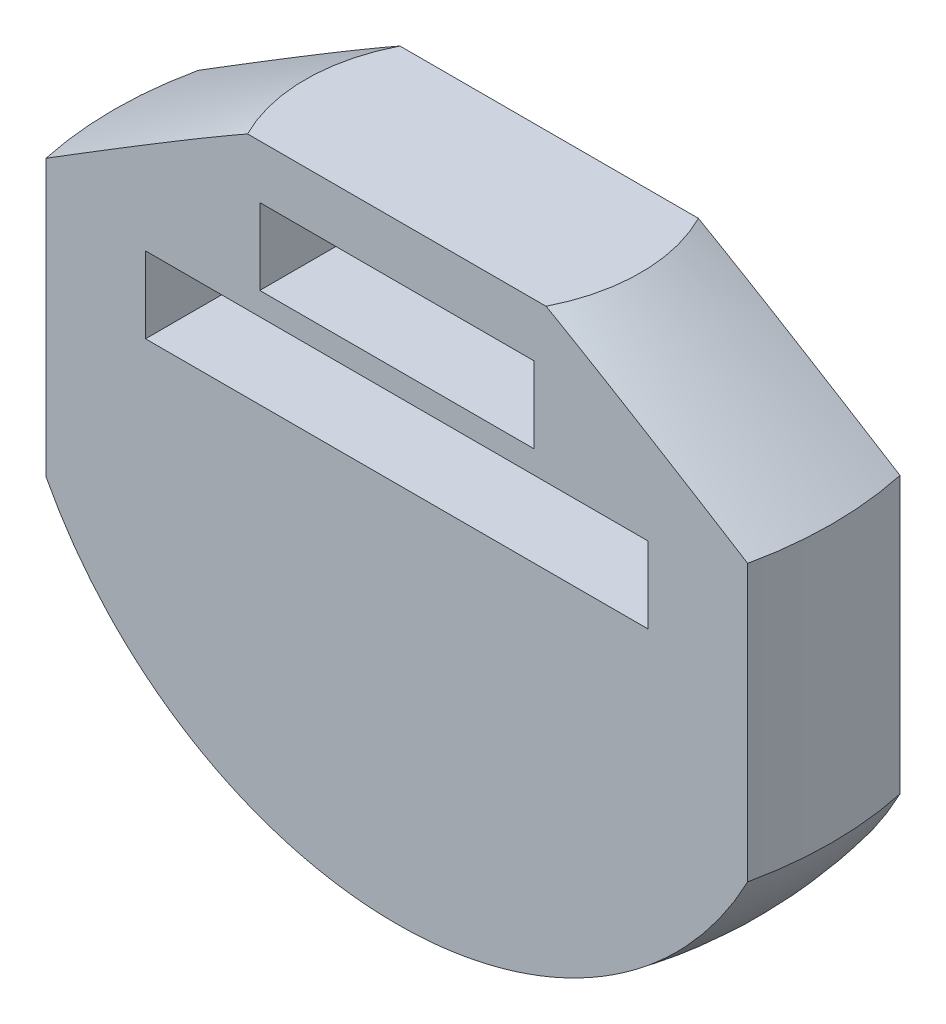
ISO-10303-21;
HEADER;
FILE_DESCRIPTION(('STEP AP214'),'2;1');
FILE_NAME('part.step','',(''),(''),'','','');
FILE_SCHEMA(('AUTOMOTIVE_DESIGN { 1 0 10303 214 1 1 1 1 }'));
ENDSEC;
DATA;
#1=APPLICATION_CONTEXT('core data for automotive mechanical design processes');
#2=APPLICATION_PROTOCOL_DEFINITION('international standard','automotive_design',2000,#1);
#3=PRODUCT_CONTEXT('',#1,'mechanical');
#4=PRODUCT('Part','Part','',(#3));
#5=PRODUCT_RELATED_PRODUCT_CATEGORY('part','',(#4));
#6=PRODUCT_DEFINITION_FORMATION('','',#4);
#7=PRODUCT_DEFINITION_CONTEXT('part definition',#1,'design');
#8=PRODUCT_DEFINITION('design','',#6,#7);
#9=PRODUCT_DEFINITION_SHAPE('','',#8);
#10=(LENGTH_UNIT() NAMED_UNIT(*) SI_UNIT(.MILLI.,.METRE.));
#11=(NAMED_UNIT(*) PLANE_ANGLE_UNIT() SI_UNIT($,.RADIAN.));
#12=(NAMED_UNIT(*) SI_UNIT($,.STERADIAN.) SOLID_ANGLE_UNIT());
#13=UNCERTAINTY_MEASURE_WITH_UNIT(LENGTH_MEASURE(1.E-05),#10,'distance_accuracy_value','');
#14=(GEOMETRIC_REPRESENTATION_CONTEXT(3) GLOBAL_UNCERTAINTY_ASSIGNED_CONTEXT((#13)) GLOBAL_UNIT_ASSIGNED_CONTEXT((#10,
#11,#12)) REPRESENTATION_CONTEXT('',''));
#15=CARTESIAN_POINT('',(0.,0.,0.));
#16=DIRECTION('',(0.,0.,1.));
#17=DIRECTION('',(1.,0.,0.));
#18=AXIS2_PLACEMENT_3D('',#15,#16,#17);
#19=CARTESIAN_POINT('',(0.,0.,5.));
#20=DIRECTION('',(0.,0.,1.));
#21=DIRECTION('',(1.,0.,0.));
#22=AXIS2_PLACEMENT_3D('',#19,#20,#21);
#23=PLANE('',#22);
#24=DIRECTION('',(1.,0.,0.));
#25=VECTOR('',#24,1.);
#26=CARTESIAN_POINT('',(0.,-1.,5.));
#27=LINE('',#26,#25);
#28=CARTESIAN_POINT('',(-16.5,-1.,5.));
#29=VERTEX_POINT('',#28);
#30=CARTESIAN_POINT('',(16.5,-1.,5.));
#31=VERTEX_POINT('',#30);
#32=EDGE_CURVE('E62',#29,#31,#27,.T.);
#33=ORIENTED_EDGE('',*,*,#32,.F.);
#34=DIRECTION('',(0.,1.,0.));
#35=VECTOR('',#34,1.);
#36=CARTESIAN_POINT('',(-16.5,0.,5.));
#37=LINE('',#36,#35);
#38=CARTESIAN_POINT('',(-16.5,4.,5.));
#39=VERTEX_POINT('',#38);
#40=EDGE_CURVE('E185',#29,#39,#37,.T.);
#41=ORIENTED_EDGE('',*,*,#40,.T.);
#42=DIRECTION('',(1.,0.,0.));
#43=VECTOR('',#42,1.);
#44=CARTESIAN_POINT('',(0.,4.,5.));
#45=LINE('',#44,#43);
#46=CARTESIAN_POINT('',(16.5,4.,5.));
#47=VERTEX_POINT('',#46);
#48=EDGE_CURVE('E182',#39,#47,#45,.T.);
#49=ORIENTED_EDGE('',*,*,#48,.T.);
#50=DIRECTION('',(0.,1.,0.));
#51=VECTOR('',#50,1.);
#52=CARTESIAN_POINT('',(16.5,0.,5.));
#53=LINE('',#52,#51);
#54=EDGE_CURVE('E179',#31,#47,#53,.T.);
#55=ORIENTED_EDGE('',*,*,#54,.F.);
#56=EDGE_LOOP('',(#33,#41,#49,#55));
#57=FACE_BOUND('',#56,.T.);
#58=DIRECTION('',(0.,-1.,0.));
#59=VECTOR('',#58,1.);
#60=CARTESIAN_POINT('',(23.0335602979652,0.,5.));
#61=LINE('',#60,#59);
#62=CARTESIAN_POINT('',(23.0335602979652,-12.112188076479,5.));
#63=VERTEX_POINT('',#62);
#64=CARTESIAN_POINT('',(23.0335602979652,6.,5.));
#65=VERTEX_POINT('',#64);
#66=EDGE_CURVE('E263',#63,#65,#61,.F.);
#67=ORIENTED_EDGE('',*,*,#66,.T.);
#68=CARTESIAN_POINT('',(23.0346857872476,5.9993,5.));
#69=CARTESIAN_POINT('',(22.5882172196151,6.27697568074402,5.));
#70=CARTESIAN_POINT('',(22.1415911746628,6.55439854641514,5.));
#71=CARTESIAN_POINT('',(21.2479499721304,7.10861896232179,5.));
#72=CARTESIAN_POINT('',(20.8009348137086,7.38541651119985,5.));
#73=CARTESIAN_POINT('',(19.9062942051283,7.93835746705625,5.));
#74=CARTESIAN_POINT('',(19.4586686012947,8.21450062546615,5.));
#75=CARTESIAN_POINT('',(18.562857227772,8.76587622631972,5.));
#76=CARTESIAN_POINT('',(18.1146714585814,9.04110866957331,5.));
#77=CARTESIAN_POINT('',(17.2160420306201,9.5914127087992,5.));
#78=CARTESIAN_POINT('',(16.7655959603001,9.86648036833733,5.));
#79=CARTESIAN_POINT('',(15.8638416814186,10.4151990066453,5.));
#80=CARTESIAN_POINT('',(15.4125334734409,10.6888499863739,5.));
#81=CARTESIAN_POINT('',(14.5089549089952,11.2342661881661,5.));
#82=CARTESIAN_POINT('',(14.0566848656075,11.5060319285759,5.));
#83=CARTESIAN_POINT('',(13.1507421187901,12.0472129272659,5.));
#84=CARTESIAN_POINT('',(12.6970694231379,12.3166281985472,5.));
#85=CARTESIAN_POINT('',(11.8983388285491,12.7872306101724,5.));
#86=CARTESIAN_POINT('',(11.5536763873788,12.9890885207726,5.));
#87=CARTESIAN_POINT('',(10.8630222159022,13.3905162260986,5.));
#88=CARTESIAN_POINT('',(10.5170304924953,13.5900860326789,5.));
#89=CARTESIAN_POINT('',(9.82307781006192,13.9864344147499,5.));
#90=CARTESIAN_POINT('',(9.47511548344891,14.183210599487,5.));
#91=CARTESIAN_POINT('',(8.77702218547323,14.5728571931224,5.));
#92=CARTESIAN_POINT('',(8.42689129815776,14.7657277521697,5.));
#93=CARTESIAN_POINT('',(7.72284025095291,15.1466985810903,5.));
#94=CARTESIAN_POINT('',(7.36891252300929,15.3347848993011,5.));
#95=CARTESIAN_POINT('',(6.65715256986337,15.7036448651853,5.));
#96=CARTESIAN_POINT('',(6.29931965217912,15.884417188257,5.));
#97=CARTESIAN_POINT('',(5.75890555557901,16.1475100388397,5.));
#98=CARTESIAN_POINT('',(5.57826482988499,16.2338146405027,5.));
#99=CARTESIAN_POINT('',(5.2154771481313,16.4031913621552,5.));
#100=CARTESIAN_POINT('',(5.03333024797371,16.4862636014674,5.));
#101=CARTESIAN_POINT('',(4.66734579345128,16.648444801556,5.));
#102=CARTESIAN_POINT('',(4.48350880873434,16.7275550436675,5.));
#103=CARTESIAN_POINT('',(4.11383471436736,16.880936474782,5.));
#104=CARTESIAN_POINT('',(3.92799778899169,16.9552081052409,5.));
#105=CARTESIAN_POINT('',(3.60667929881854,17.0777174871613,5.));
#106=CARTESIAN_POINT('',(3.47174927820533,17.127398195899,5.));
#107=CARTESIAN_POINT('',(3.20062218638702,17.2231700515735,5.));
#108=CARTESIAN_POINT('',(3.06442510393172,17.2692611666044,5.));
#109=CARTESIAN_POINT('',(2.65379329895907,17.4013179386471,5.));
#110=CARTESIAN_POINT('',(2.37730698398799,17.4810713251482,5.));
#111=CARTESIAN_POINT('',(1.82239272640798,17.6176842384708,5.));
#112=CARTESIAN_POINT('',(1.54403774542656,17.6748301660928,5.));
#113=CARTESIAN_POINT('',(1.12343487433904,17.7404310517827,5.));
#114=CARTESIAN_POINT('',(0.9827305580897,17.7589445148431,5.));
#115=CARTESIAN_POINT('',(0.700546994628327,17.7887521595786,5.));
#116=CARTESIAN_POINT('',(0.559067754885636,17.8000464107153,5.));
#117=CARTESIAN_POINT('',(0.273696780786459,17.8151550344127,5.));
#118=CARTESIAN_POINT('',(0.12979926685556,17.8188611590377,5.));
#119=CARTESIAN_POINT('',(-0.157981097522683,17.8183450712248,5.));
#120=CARTESIAN_POINT('',(-0.301863947955453,17.8141228509817,5.));
#121=CARTESIAN_POINT('',(-0.589208534702586,17.7978917787802,5.));
#122=CARTESIAN_POINT('',(-0.732670207467966,17.7858818068969,5.));
#123=CARTESIAN_POINT('',(-1.01876730953592,17.7544725921633,5.));
#124=CARTESIAN_POINT('',(-1.16140272180758,17.7350731975482,5.));
#125=CARTESIAN_POINT('',(-1.59118453533009,17.6660600293004,5.));
#126=CARTESIAN_POINT('',(-1.87667460116399,17.6058530840348,5.));
#127=CARTESIAN_POINT('',(-2.30052783643319,17.4989220225851,5.));
#128=CARTESIAN_POINT('',(-2.44111326687,17.4604976466826,5.));
#129=CARTESIAN_POINT('',(-2.72088012377249,17.3788224435363,5.));
#130=CARTESIAN_POINT('',(-2.86006160066302,17.3355717903125,5.));
#131=CARTESIAN_POINT('',(-3.218993912327,17.2180887285255,5.));
#132=CARTESIAN_POINT('',(-3.43769682517703,17.1406649661272,5.));
#133=CARTESIAN_POINT('',(-3.87201464910717,16.9775451448598,5.));
#134=CARTESIAN_POINT('',(-4.08762886763519,16.8918472630899,5.));
#135=CARTESIAN_POINT('',(-4.51633600453019,16.7138963999243,5.));
#136=CARTESIAN_POINT('',(-4.72942660921873,16.6216378757955,5.));
#137=CARTESIAN_POINT('',(-5.15329251212147,16.4320136092775,5.));
#138=CARTESIAN_POINT('',(-5.36406798084878,16.3346482461065,5.));
#139=CARTESIAN_POINT('',(-5.78425004105665,16.135584038612,5.));
#140=CARTESIAN_POINT('',(-5.99365142727802,16.0338742451384,5.));
#141=CARTESIAN_POINT('',(-6.41082651434501,15.8271713316228,5.));
#142=CARTESIAN_POINT('',(-6.61860019227514,15.7221781654597,5.));
#143=CARTESIAN_POINT('',(-7.03268055387987,15.5095800340978,5.));
#144=CARTESIAN_POINT('',(-7.23898788270627,15.401976322967,5.));
#145=CARTESIAN_POINT('',(-7.65044931182385,15.1845837940254,5.));
#146=CARTESIAN_POINT('',(-7.8556033971339,15.0747949479126,5.));
#147=CARTESIAN_POINT('',(-8.47173674154544,14.741583181369,5.));
#148=CARTESIAN_POINT('',(-8.88123840120707,14.5154286564637,5.));
#149=CARTESIAN_POINT('',(-9.69742172067921,14.0580180755452,5.));
#150=CARTESIAN_POINT('',(-10.1041030969385,13.8267615160734,5.));
#151=CARTESIAN_POINT('',(-10.9146474043388,13.3609316077416,5.));
#152=CARTESIAN_POINT('',(-11.3185139300348,13.1263645046426,5.));
#153=CARTESIAN_POINT('',(-12.1246122591814,12.6544707498011,5.));
#154=CARTESIAN_POINT('',(-12.5268441122675,12.4171441827047,5.));
#155=CARTESIAN_POINT('',(-13.3558839776514,11.925034539026,5.));
#156=CARTESIAN_POINT('',(-13.7826083372758,11.6701106548025,5.));
#157=CARTESIAN_POINT('',(-14.6349458748764,11.1584060395956,5.));
#158=CARTESIAN_POINT('',(-15.0605590439001,10.9016252937145,5.));
#159=CARTESIAN_POINT('',(-16.3365556494194,10.128834137339,5.));
#160=CARTESIAN_POINT('',(-17.1856255055322,9.6106555173002,5.));
#161=CARTESIAN_POINT('',(-18.8691130499005,8.578157533305,5.));
#162=CARTESIAN_POINT('',(-19.7035638627726,8.06389206705063,5.));
#163=CARTESIAN_POINT('',(-20.9538296704114,7.29075735007925,5.));
#164=CARTESIAN_POINT('',(-21.3702286406458,7.03283183073527,5.));
#165=CARTESIAN_POINT('',(-22.2026931064136,6.51644495591639,5.));
#166=CARTESIAN_POINT('',(-22.6187586025915,6.25798360148071,5.));
#167=CARTESIAN_POINT('',(-23.0346857872476,5.9993,5.));
#168=B_SPLINE_CURVE_WITH_KNOTS('',3,(#68,#69,#70,#71,#72,#73,#74,#75,#76,#77,#78,#79,#80,#81,
#82,#83,#84,#85,#86,#87,#88,#89,#90,#91,#92,#93,#94,#95,#96,#97,#98,#99,#100,#101,#102,#103,
#104,#105,#106,#107,#108,#109,#110,#111,#112,#113,#114,#115,#116,#117,#118,#119,#120,#121,#122,
#123,#124,#125,#126,#127,#128,#129,#130,#131,#132,#133,#134,#135,#136,#137,#138,#139,#140,#141,
#142,#143,#144,#145,#146,#147,#148,#149,#150,#151,#152,#153,#154,#155,#156,#157,#158,#159,#160,
#161,#162,#163,#164,#165,#166,#167),.UNSPECIFIED.,.F.,.F.,(4,2,2,2,2,2,2,2,2,2,2,2,2,2,2,2,2,2,
2,2,2,2,2,2,2,2,2,2,2,2,2,2,2,2,2,2,2,2,2,2,2,2,2,2,2,2,2,2,2,4),(0.,1.57732127119599,
3.15464596323464,4.73249598974029,6.31034461262967,7.89371711994419,9.47708855547543,
11.0600058618525,12.6429144070517,13.8411771045081,15.0394335910509,16.2386602493324,
17.437840716296,18.640189892466,19.8427558542979,20.4433277065557,21.0438773675906,
21.6442315359501,22.2445308534324,22.6758410231748,23.1071550261663,23.9697475520898,
24.8210327471299,25.2466252357663,25.6722136293907,26.1038320810747,26.5354509576685,
26.9671319173892,27.398821743498,28.2727710156251,28.7099436305915,29.1471004876114,
29.842882205042,30.5388175639555,31.2353480312617,31.9318268493867,32.630178579675,
33.3285401240171,34.0265725806297,34.7246140841156,36.1279563056992,37.5314376311884,
38.9325539599299,40.3336274223991,41.8248350984396,43.3160547519143,46.3001381064741,
49.240710048683,50.7101392005471,52.1795655051984),.UNSPECIFIED.);
#169=CARTESIAN_POINT('',(9.79795897113271,14.,5.));
#170=VERTEX_POINT('',#169);
#171=EDGE_CURVE('E265',#65,#170,#168,.T.);
#172=ORIENTED_EDGE('',*,*,#171,.T.);
#173=DIRECTION('',(1.,0.,0.));
#174=VECTOR('',#173,1.);
#175=CARTESIAN_POINT('',(0.,14.,5.));
#176=LINE('',#175,#174);
#177=CARTESIAN_POINT('',(-9.79795897113271,14.,5.));
#178=VERTEX_POINT('',#177);
#179=EDGE_CURVE('E11',#178,#170,#176,.T.);
#180=ORIENTED_EDGE('',*,*,#179,.F.);
#181=CARTESIAN_POINT('',(-23.0335602979652,6.,5.));
#182=VERTEX_POINT('',#181);
#183=EDGE_CURVE('E224',#178,#182,#168,.T.);
#184=ORIENTED_EDGE('',*,*,#183,.T.);
#185=DIRECTION('',(0.,-1.,0.));
#186=VECTOR('',#185,1.);
#187=CARTESIAN_POINT('',(-23.0335602979652,0.,5.));
#188=LINE('',#187,#186);
#189=CARTESIAN_POINT('',(-23.0335602979652,-12.112188076479,5.));
#190=VERTEX_POINT('',#189);
#191=EDGE_CURVE('E271',#182,#190,#188,.T.);
#192=ORIENTED_EDGE('',*,*,#191,.T.);
#193=CARTESIAN_POINT('',(0.,0.,5.));
#194=DIRECTION('',(0.,0.,1.));
#195=DIRECTION('',(1.,0.,0.));
#196=AXIS2_PLACEMENT_3D('',#193,#194,#195);
#197=CIRCLE('',#196,26.0240273593462);
#198=EDGE_CURVE('E267',#190,#63,#197,.T.);
#199=ORIENTED_EDGE('',*,*,#198,.T.);
#200=EDGE_LOOP('',(#67,#172,#180,#184,#192,#199));
#201=FACE_BOUND('',#200,.T.);
#202=DIRECTION('',(1.,0.,0.));
#203=VECTOR('',#202,1.);
#204=CARTESIAN_POINT('',(0.,10.5,5.));
#205=LINE('',#204,#203);
#206=CARTESIAN_POINT('',(-9.,10.5,5.));
#207=VERTEX_POINT('',#206);
#208=CARTESIAN_POINT('',(9.,10.5,5.));
#209=VERTEX_POINT('',#208);
#210=EDGE_CURVE('E155',#207,#209,#205,.T.);
#211=ORIENTED_EDGE('',*,*,#210,.T.);
#212=DIRECTION('',(0.,-1.,0.));
#213=VECTOR('',#212,1.);
#214=CARTESIAN_POINT('',(9.,0.,5.));
#215=LINE('',#214,#213);
#216=CARTESIAN_POINT('',(9.,5.5,5.));
#217=VERTEX_POINT('',#216);
#218=EDGE_CURVE('E54',#209,#217,#215,.T.);
#219=ORIENTED_EDGE('',*,*,#218,.T.);
#220=DIRECTION('',(1.,0.,0.));
#221=VECTOR('',#220,1.);
#222=CARTESIAN_POINT('',(0.,5.5,5.));
#223=LINE('',#222,#221);
#224=CARTESIAN_POINT('',(-9.,5.5,5.));
#225=VERTEX_POINT('',#224);
#226=EDGE_CURVE('E160',#225,#217,#223,.T.);
#227=ORIENTED_EDGE('',*,*,#226,.F.);
#228=DIRECTION('',(0.,-1.,0.));
#229=VECTOR('',#228,1.);
#230=CARTESIAN_POINT('',(-9.,0.,5.));
#231=LINE('',#230,#229);
#232=EDGE_CURVE('E145',#207,#225,#231,.T.);
#233=ORIENTED_EDGE('',*,*,#232,.F.);
#234=EDGE_LOOP('',(#211,#219,#227,#233));
#235=FACE_BOUND('',#234,.T.);
#236=ADVANCED_FACE('F39',(#57,#201,#235),#23,.T.);
#237=CARTESIAN_POINT('',(0.,0.,-5.));
#238=DIRECTION('',(0.,0.,1.));
#239=DIRECTION('',(1.,0.,0.));
#240=AXIS2_PLACEMENT_3D('',#237,#238,#239);
#241=PLANE('',#240);
#242=CARTESIAN_POINT('',(23.0346857872476,5.9993,-5.));
#243=CARTESIAN_POINT('',(22.5882172196151,6.27697568074402,-5.));
#244=CARTESIAN_POINT('',(22.1415911746628,6.55439854641514,-5.));
#245=CARTESIAN_POINT('',(21.2479499721304,7.10861896232179,-5.));
#246=CARTESIAN_POINT('',(20.8009348137086,7.38541651119985,-5.));
#247=CARTESIAN_POINT('',(19.9062942051283,7.93835746705625,-5.));
#248=CARTESIAN_POINT('',(19.4586686012947,8.21450062546615,-5.));
#249=CARTESIAN_POINT('',(18.562857227772,8.76587622631972,-5.));
#250=CARTESIAN_POINT('',(18.1146714585814,9.04110866957331,-5.));
#251=CARTESIAN_POINT('',(17.2160420306201,9.5914127087992,-5.));
#252=CARTESIAN_POINT('',(16.7655959603001,9.86648036833733,-5.));
#253=CARTESIAN_POINT('',(15.8638416814186,10.4151990066453,-5.));
#254=CARTESIAN_POINT('',(15.4125334734409,10.6888499863739,-5.));
#255=CARTESIAN_POINT('',(14.5089549089952,11.2342661881661,-5.));
#256=CARTESIAN_POINT('',(14.0566848656075,11.5060319285759,-5.));
#257=CARTESIAN_POINT('',(13.1507421187901,12.0472129272659,-5.));
#258=CARTESIAN_POINT('',(12.6970694231379,12.3166281985472,-5.));
#259=CARTESIAN_POINT('',(11.8983388285491,12.7872306101724,-5.));
#260=CARTESIAN_POINT('',(11.5536763873788,12.9890885207726,-5.));
#261=CARTESIAN_POINT('',(10.8630222159022,13.3905162260986,-5.));
#262=CARTESIAN_POINT('',(10.5170304924953,13.5900860326789,-5.));
#263=CARTESIAN_POINT('',(9.82307781006192,13.9864344147499,-5.));
#264=CARTESIAN_POINT('',(9.47511548344891,14.183210599487,-5.));
#265=CARTESIAN_POINT('',(8.77702218547323,14.5728571931224,-5.));
#266=CARTESIAN_POINT('',(8.42689129815776,14.7657277521697,-5.));
#267=CARTESIAN_POINT('',(7.72284025095291,15.1466985810903,-5.));
#268=CARTESIAN_POINT('',(7.36891252300929,15.3347848993011,-5.));
#269=CARTESIAN_POINT('',(6.65715256986337,15.7036448651853,-5.));
#270=CARTESIAN_POINT('',(6.29931965217912,15.884417188257,-5.));
#271=CARTESIAN_POINT('',(5.75890555557901,16.1475100388397,-5.));
#272=CARTESIAN_POINT('',(5.57826482988499,16.2338146405027,-5.));
#273=CARTESIAN_POINT('',(5.2154771481313,16.4031913621552,-5.));
#274=CARTESIAN_POINT('',(5.03333024797371,16.4862636014674,-5.));
#275=CARTESIAN_POINT('',(4.66734579345128,16.648444801556,-5.));
#276=CARTESIAN_POINT('',(4.48350880873434,16.7275550436675,-5.));
#277=CARTESIAN_POINT('',(4.11383471436736,16.880936474782,-5.));
#278=CARTESIAN_POINT('',(3.92799778899169,16.9552081052409,-5.));
#279=CARTESIAN_POINT('',(3.60667929881854,17.0777174871613,-5.));
#280=CARTESIAN_POINT('',(3.47174927820533,17.127398195899,-5.));
#281=CARTESIAN_POINT('',(3.20062218638702,17.2231700515735,-5.));
#282=CARTESIAN_POINT('',(3.06442510393172,17.2692611666044,-5.));
#283=CARTESIAN_POINT('',(2.65379329895907,17.4013179386471,-5.));
#284=CARTESIAN_POINT('',(2.37730698398799,17.4810713251482,-5.));
#285=CARTESIAN_POINT('',(1.82239272640798,17.6176842384708,-5.));
#286=CARTESIAN_POINT('',(1.54403774542656,17.6748301660928,-5.));
#287=CARTESIAN_POINT('',(1.12343487433904,17.7404310517827,-5.));
#288=CARTESIAN_POINT('',(0.9827305580897,17.7589445148431,-5.));
#289=CARTESIAN_POINT('',(0.700546994628327,17.7887521595786,-5.));
#290=CARTESIAN_POINT('',(0.559067754885636,17.8000464107153,-5.));
#291=CARTESIAN_POINT('',(0.273696780786459,17.8151550344127,-5.));
#292=CARTESIAN_POINT('',(0.12979926685556,17.8188611590377,-5.));
#293=CARTESIAN_POINT('',(-0.157981097522683,17.8183450712248,-5.));
#294=CARTESIAN_POINT('',(-0.301863947955453,17.8141228509817,-5.));
#295=CARTESIAN_POINT('',(-0.589208534702586,17.7978917787802,-5.));
#296=CARTESIAN_POINT('',(-0.732670207467966,17.7858818068969,-5.));
#297=CARTESIAN_POINT('',(-1.01876730953592,17.7544725921633,-5.));
#298=CARTESIAN_POINT('',(-1.16140272180758,17.7350731975482,-5.));
#299=CARTESIAN_POINT('',(-1.59118453533009,17.6660600293004,-5.));
#300=CARTESIAN_POINT('',(-1.87667460116399,17.6058530840348,-5.));
#301=CARTESIAN_POINT('',(-2.30052783643319,17.4989220225851,-5.));
#302=CARTESIAN_POINT('',(-2.44111326687,17.4604976466826,-5.));
#303=CARTESIAN_POINT('',(-2.72088012377249,17.3788224435363,-5.));
#304=CARTESIAN_POINT('',(-2.86006160066302,17.3355717903125,-5.));
#305=CARTESIAN_POINT('',(-3.218993912327,17.2180887285255,-5.));
#306=CARTESIAN_POINT('',(-3.43769682517703,17.1406649661272,-5.));
#307=CARTESIAN_POINT('',(-3.87201464910717,16.9775451448598,-5.));
#308=CARTESIAN_POINT('',(-4.08762886763519,16.8918472630899,-5.));
#309=CARTESIAN_POINT('',(-4.51633600453019,16.7138963999243,-5.));
#310=CARTESIAN_POINT('',(-4.72942660921873,16.6216378757955,-5.));
#311=CARTESIAN_POINT('',(-5.15329251212147,16.4320136092775,-5.));
#312=CARTESIAN_POINT('',(-5.36406798084878,16.3346482461065,-5.));
#313=CARTESIAN_POINT('',(-5.78425004105665,16.135584038612,-5.));
#314=CARTESIAN_POINT('',(-5.99365142727802,16.0338742451384,-5.));
#315=CARTESIAN_POINT('',(-6.41082651434501,15.8271713316228,-5.));
#316=CARTESIAN_POINT('',(-6.61860019227514,15.7221781654597,-5.));
#317=CARTESIAN_POINT('',(-7.03268055387987,15.5095800340978,-5.));
#318=CARTESIAN_POINT('',(-7.23898788270627,15.401976322967,-5.));
#319=CARTESIAN_POINT('',(-7.65044931182385,15.1845837940254,-5.));
#320=CARTESIAN_POINT('',(-7.8556033971339,15.0747949479126,-5.));
#321=CARTESIAN_POINT('',(-8.47173674154544,14.741583181369,-5.));
#322=CARTESIAN_POINT('',(-8.88123840120707,14.5154286564637,-5.));
#323=CARTESIAN_POINT('',(-9.69742172067921,14.0580180755452,-5.));
#324=CARTESIAN_POINT('',(-10.1041030969385,13.8267615160734,-5.));
#325=CARTESIAN_POINT('',(-10.9146474043388,13.3609316077416,-5.));
#326=CARTESIAN_POINT('',(-11.3185139300348,13.1263645046426,-5.));
#327=CARTESIAN_POINT('',(-12.1246122591814,12.6544707498011,-5.));
#328=CARTESIAN_POINT('',(-12.5268441122675,12.4171441827047,-5.));
#329=CARTESIAN_POINT('',(-13.3558839776514,11.925034539026,-5.));
#330=CARTESIAN_POINT('',(-13.7826083372758,11.6701106548025,-5.));
#331=CARTESIAN_POINT('',(-14.6349458748764,11.1584060395956,-5.));
#332=CARTESIAN_POINT('',(-15.0605590439001,10.9016252937145,-5.));
#333=CARTESIAN_POINT('',(-16.3365556494194,10.128834137339,-5.));
#334=CARTESIAN_POINT('',(-17.1856255055322,9.6106555173002,-5.));
#335=CARTESIAN_POINT('',(-18.8691130499005,8.578157533305,-5.));
#336=CARTESIAN_POINT('',(-19.7035638627726,8.06389206705063,-5.));
#337=CARTESIAN_POINT('',(-20.9538296704114,7.29075735007925,-5.));
#338=CARTESIAN_POINT('',(-21.3702286406458,7.03283183073527,-5.));
#339=CARTESIAN_POINT('',(-22.2026931064136,6.51644495591639,-5.));
#340=CARTESIAN_POINT('',(-22.6187586025915,6.25798360148071,-5.));
#341=CARTESIAN_POINT('',(-23.0346857872476,5.9993,-5.));
#342=B_SPLINE_CURVE_WITH_KNOTS('',3,(#242,#243,#244,#245,#246,#247,#248,#249,#250,#251,#252,
#253,#254,#255,#256,#257,#258,#259,#260,#261,#262,#263,#264,#265,#266,#267,#268,#269,#270,#271,
#272,#273,#274,#275,#276,#277,#278,#279,#280,#281,#282,#283,#284,#285,#286,#287,#288,#289,#290,
#291,#292,#293,#294,#295,#296,#297,#298,#299,#300,#301,#302,#303,#304,#305,#306,#307,#308,#309,
#310,#311,#312,#313,#314,#315,#316,#317,#318,#319,#320,#321,#322,#323,#324,#325,#326,#327,#328,
#329,#330,#331,#332,#333,#334,#335,#336,#337,#338,#339,#340,#341),.UNSPECIFIED.,.F.,.F.,(4,2,2,
2,2,2,2,2,2,2,2,2,2,2,2,2,2,2,2,2,2,2,2,2,2,2,2,2,2,2,2,2,2,2,2,2,2,2,2,2,2,2,2,2,2,2,2,2,2,4),
(0.,1.57732127119599,3.15464596323464,4.73249598974029,6.31034461262967,7.89371711994419,
9.47708855547543,11.0600058618525,12.6429144070517,13.8411771045081,15.0394335910509,
16.2386602493324,17.437840716296,18.640189892466,19.8427558542979,20.4433277065557,
21.0438773675906,21.6442315359501,22.2445308534324,22.6758410231748,23.1071550261663,
23.9697475520898,24.8210327471299,25.2466252357663,25.6722136293907,26.1038320810747,
26.5354509576685,26.9671319173892,27.398821743498,28.2727710156251,28.7099436305915,
29.1471004876114,29.842882205042,30.5388175639555,31.2353480312617,31.9318268493867,
32.630178579675,33.3285401240171,34.0265725806297,34.7246140841156,36.1279563056992,
37.5314376311884,38.9325539599299,40.3336274223991,41.8248350984396,43.3160547519143,
46.3001381064741,49.240710048683,50.7101392005471,52.1795655051984),.UNSPECIFIED.);
#343=CARTESIAN_POINT('',(23.0335602979652,6.,-5.));
#344=VERTEX_POINT('',#343);
#345=CARTESIAN_POINT('',(9.79795897113271,14.,-5.));
#346=VERTEX_POINT('',#345);
#347=EDGE_CURVE('E223',#344,#346,#342,.T.);
#348=ORIENTED_EDGE('',*,*,#347,.F.);
#349=DIRECTION('',(0.,-1.,0.));
#350=VECTOR('',#349,1.);
#351=CARTESIAN_POINT('',(23.0335602979652,0.,-5.));
#352=LINE('',#351,#350);
#353=CARTESIAN_POINT('',(23.0335602979652,-12.112188076479,-5.));
#354=VERTEX_POINT('',#353);
#355=EDGE_CURVE('E277',#354,#344,#352,.F.);
#356=ORIENTED_EDGE('',*,*,#355,.F.);
#357=CARTESIAN_POINT('',(0.,0.,-5.));
#358=DIRECTION('',(0.,0.,1.));
#359=DIRECTION('',(1.,0.,0.));
#360=AXIS2_PLACEMENT_3D('',#357,#358,#359);
#361=CIRCLE('',#360,26.0240273593462);
#362=CARTESIAN_POINT('',(-23.0335602979652,-12.112188076479,-5.));
#363=VERTEX_POINT('',#362);
#364=EDGE_CURVE('E274',#363,#354,#361,.T.);
#365=ORIENTED_EDGE('',*,*,#364,.F.);
#366=DIRECTION('',(0.,-1.,0.));
#367=VECTOR('',#366,1.);
#368=CARTESIAN_POINT('',(-23.0335602979652,0.,-5.));
#369=LINE('',#368,#367);
#370=CARTESIAN_POINT('',(-23.0335602979652,6.,-5.));
#371=VERTEX_POINT('',#370);
#372=EDGE_CURVE('E272',#371,#363,#369,.T.);
#373=ORIENTED_EDGE('',*,*,#372,.F.);
#374=CARTESIAN_POINT('',(-9.79795897113271,14.,-5.));
#375=VERTEX_POINT('',#374);
#376=EDGE_CURVE('E215',#375,#371,#342,.T.);
#377=ORIENTED_EDGE('',*,*,#376,.F.);
#378=DIRECTION('',(1.,0.,0.));
#379=VECTOR('',#378,1.);
#380=CARTESIAN_POINT('',(0.,14.,-5.));
#381=LINE('',#380,#379);
#382=EDGE_CURVE('E43',#375,#346,#381,.T.);
#383=ORIENTED_EDGE('',*,*,#382,.T.);
#384=EDGE_LOOP('',(#348,#356,#365,#373,#377,#383));
#385=FACE_BOUND('',#384,.T.);
#386=DIRECTION('',(0.,1.,0.));
#387=VECTOR('',#386,1.);
#388=CARTESIAN_POINT('',(-16.5,0.,-5.));
#389=LINE('',#388,#387);
#390=CARTESIAN_POINT('',(-16.5,-1.,-5.));
#391=VERTEX_POINT('',#390);
#392=CARTESIAN_POINT('',(-16.5,4.,-5.));
#393=VERTEX_POINT('',#392);
#394=EDGE_CURVE('E197',#391,#393,#389,.T.);
#395=ORIENTED_EDGE('',*,*,#394,.F.);
#396=DIRECTION('',(1.,0.,0.));
#397=VECTOR('',#396,1.);
#398=CARTESIAN_POINT('',(0.,-1.,-5.));
#399=LINE('',#398,#397);
#400=CARTESIAN_POINT('',(16.5,-1.,-5.));
#401=VERTEX_POINT('',#400);
#402=EDGE_CURVE('E188',#391,#401,#399,.T.);
#403=ORIENTED_EDGE('',*,*,#402,.T.);
#404=DIRECTION('',(0.,1.,0.));
#405=VECTOR('',#404,1.);
#406=CARTESIAN_POINT('',(16.5,0.,-5.));
#407=LINE('',#406,#405);
#408=CARTESIAN_POINT('',(16.5,4.,-5.));
#409=VERTEX_POINT('',#408);
#410=EDGE_CURVE('E191',#401,#409,#407,.T.);
#411=ORIENTED_EDGE('',*,*,#410,.T.);
#412=DIRECTION('',(1.,0.,0.));
#413=VECTOR('',#412,1.);
#414=CARTESIAN_POINT('',(0.,4.,-5.));
#415=LINE('',#414,#413);
#416=EDGE_CURVE('E194',#393,#409,#415,.T.);
#417=ORIENTED_EDGE('',*,*,#416,.F.);
#418=EDGE_LOOP('',(#395,#403,#411,#417));
#419=FACE_BOUND('',#418,.T.);
#420=DIRECTION('',(0.,-1.,0.));
#421=VECTOR('',#420,1.);
#422=CARTESIAN_POINT('',(9.,0.,-5.));
#423=LINE('',#422,#421);
#424=CARTESIAN_POINT('',(9.,10.5,-5.));
#425=VERTEX_POINT('',#424);
#426=CARTESIAN_POINT('',(9.,5.5,-5.));
#427=VERTEX_POINT('',#426);
#428=EDGE_CURVE('E162',#425,#427,#423,.T.);
#429=ORIENTED_EDGE('',*,*,#428,.F.);
#430=DIRECTION('',(1.,0.,0.));
#431=VECTOR('',#430,1.);
#432=CARTESIAN_POINT('',(0.,10.5,-5.));
#433=LINE('',#432,#431);
#434=CARTESIAN_POINT('',(-9.,10.5,-5.));
#435=VERTEX_POINT('',#434);
#436=EDGE_CURVE('E167',#435,#425,#433,.T.);
#437=ORIENTED_EDGE('',*,*,#436,.F.);
#438=DIRECTION('',(0.,-1.,0.));
#439=VECTOR('',#438,1.);
#440=CARTESIAN_POINT('',(-9.,0.,-5.));
#441=LINE('',#440,#439);
#442=CARTESIAN_POINT('',(-9.,5.5,-5.));
#443=VERTEX_POINT('',#442);
#444=EDGE_CURVE('E148',#435,#443,#441,.T.);
#445=ORIENTED_EDGE('',*,*,#444,.T.);
#446=DIRECTION('',(1.,0.,0.));
#447=VECTOR('',#446,1.);
#448=CARTESIAN_POINT('',(0.,5.5,-5.));
#449=LINE('',#448,#447);
#450=EDGE_CURVE('E170',#443,#427,#449,.T.);
#451=ORIENTED_EDGE('',*,*,#450,.T.);
#452=EDGE_LOOP('',(#429,#437,#445,#451));
#453=FACE_BOUND('',#452,.T.);
#454=ADVANCED_FACE('F231',(#385,#419,#453),#241,.F.);
#455=CARTESIAN_POINT('',(0.,14.,5.));
#456=DIRECTION('',(0.,1.,0.));
#457=DIRECTION('',(0.,0.,1.));
#458=AXIS2_PLACEMENT_3D('',#455,#456,#457);
#459=PLANE('',#458);
#460=ORIENTED_EDGE('',*,*,#179,.T.);
#461=CARTESIAN_POINT('',(0.,14.,0.));
#462=DIRECTION('',(0.,-1.,0.));
#463=DIRECTION('',(0.,0.,-1.));
#464=AXIS2_PLACEMENT_3D('',#461,#462,#463);
#465=CIRCLE('',#464,11.);
#466=EDGE_CURVE('E208',#346,#170,#465,.T.);
#467=ORIENTED_EDGE('',*,*,#466,.F.);
#468=ORIENTED_EDGE('',*,*,#382,.F.);
#469=EDGE_CURVE('E175',#178,#375,#465,.T.);
#470=ORIENTED_EDGE('',*,*,#469,.F.);
#471=EDGE_LOOP('',(#460,#467,#468,#470));
#472=FACE_BOUND('',#471,.T.);
#473=ADVANCED_FACE('F41',(#472),#459,.T.);
#474=CARTESIAN_POINT('',(0.,0.,0.));
#475=DIRECTION('',(0.,-1.,0.));
#476=DIRECTION('',(1.,0.,0.));
#477=AXIS2_PLACEMENT_3D('',#474,#475,#476);
#478=SPHERICAL_SURFACE('',#477,26.5);
#479=ORIENTED_EDGE('',*,*,#364,.T.);
#480=CARTESIAN_POINT('',(0.,-12.112188076479,0.));
#481=DIRECTION('',(0.,-1.,0.));
#482=DIRECTION('',(0.,0.,-1.));
#483=AXIS2_PLACEMENT_3D('',#480,#481,#482);
#484=CIRCLE('',#483,23.57);
#485=EDGE_CURVE('E214',#354,#63,#484,.T.);
#486=ORIENTED_EDGE('',*,*,#485,.T.);
#487=ORIENTED_EDGE('',*,*,#198,.F.);
#488=EDGE_CURVE('E212',#190,#363,#484,.T.);
#489=ORIENTED_EDGE('',*,*,#488,.T.);
#490=EDGE_LOOP('',(#479,#486,#487,#489));
#491=FACE_BOUND('',#490,.T.);
#492=ADVANCED_FACE('F247',(#491),#478,.T.);
#493=CARTESIAN_POINT('',(0.,0.,0.));
#494=DIRECTION('',(0.,-1.,0.));
#495=DIRECTION('',(0.,0.,-1.));
#496=AXIS2_PLACEMENT_3D('',#493,#494,#495);
#497=CYLINDRICAL_SURFACE('',#496,23.57);
#498=CARTESIAN_POINT('',(0.,6.,0.));
#499=DIRECTION('',(0.,-1.,0.));
#500=DIRECTION('',(0.,0.,-1.));
#501=AXIS2_PLACEMENT_3D('',#498,#499,#500);
#502=CIRCLE('',#501,23.57);
#503=EDGE_CURVE('E209',#182,#371,#502,.T.);
#504=ORIENTED_EDGE('',*,*,#503,.T.);
#505=ORIENTED_EDGE('',*,*,#372,.T.);
#506=ORIENTED_EDGE('',*,*,#488,.F.);
#507=ORIENTED_EDGE('',*,*,#191,.F.);
#508=EDGE_LOOP('',(#504,#505,#506,#507));
#509=FACE_BOUND('',#508,.T.);
#510=ADVANCED_FACE('F243',(#509),#497,.T.);
#511=ORIENTED_EDGE('',*,*,#485,.F.);
#512=ORIENTED_EDGE('',*,*,#355,.T.);
#513=EDGE_CURVE('E211',#344,#65,#502,.T.);
#514=ORIENTED_EDGE('',*,*,#513,.T.);
#515=ORIENTED_EDGE('',*,*,#66,.F.);
#516=EDGE_LOOP('',(#511,#512,#514,#515));
#517=FACE_BOUND('',#516,.T.);
#518=ADVANCED_FACE('F239',(#517),#497,.T.);
#519=CARTESIAN_POINT('',(0.,6.,0.));
#520=DIRECTION('',(0.,-1.,0.));
#521=DIRECTION('',(0.,0.,-1.));
#522=AXIS2_PLACEMENT_3D('',#519,#520,#521);
#523=CONICAL_SURFACE('',#522,23.57,1.0040156345198);
#524=ORIENTED_EDGE('',*,*,#469,.T.);
#525=ORIENTED_EDGE('',*,*,#376,.T.);
#526=ORIENTED_EDGE('',*,*,#503,.F.);
#527=ORIENTED_EDGE('',*,*,#183,.F.);
#528=EDGE_LOOP('',(#524,#525,#526,#527));
#529=FACE_BOUND('',#528,.T.);
#530=ADVANCED_FACE('F233',(#529),#523,.T.);
#531=ORIENTED_EDGE('',*,*,#513,.F.);
#532=ORIENTED_EDGE('',*,*,#347,.T.);
#533=ORIENTED_EDGE('',*,*,#466,.T.);
#534=ORIENTED_EDGE('',*,*,#171,.F.);
#535=EDGE_LOOP('',(#531,#532,#533,#534));
#536=FACE_BOUND('',#535,.T.);
#537=ADVANCED_FACE('F238',(#536),#523,.T.);
#538=CARTESIAN_POINT('',(0.,-1.,-5.));
#539=DIRECTION('',(0.,-1.,0.));
#540=DIRECTION('',(0.,0.,-1.));
#541=AXIS2_PLACEMENT_3D('',#538,#539,#540);
#542=PLANE('',#541);
#543=DIRECTION('',(0.,0.,1.));
#544=VECTOR('',#543,1.);
#545=CARTESIAN_POINT('',(16.5,-1.,-5.));
#546=LINE('',#545,#544);
#547=EDGE_CURVE('E199',#401,#31,#546,.T.);
#548=ORIENTED_EDGE('',*,*,#547,.F.);
#549=ORIENTED_EDGE('',*,*,#402,.F.);
#550=DIRECTION('',(0.,0.,1.));
#551=VECTOR('',#550,1.);
#552=CARTESIAN_POINT('',(-16.5,-1.,-5.));
#553=LINE('',#552,#551);
#554=EDGE_CURVE('E200',#391,#29,#553,.T.);
#555=ORIENTED_EDGE('',*,*,#554,.T.);
#556=ORIENTED_EDGE('',*,*,#32,.T.);
#557=EDGE_LOOP('',(#548,#549,#555,#556));
#558=FACE_BOUND('',#557,.T.);
#559=ADVANCED_FACE('F241',(#558),#542,.F.);
#560=CARTESIAN_POINT('',(-16.5,0.,-5.));
#561=DIRECTION('',(1.,0.,0.));
#562=DIRECTION('',(0.,0.,-1.));
#563=AXIS2_PLACEMENT_3D('',#560,#561,#562);
#564=PLANE('',#563);
#565=ORIENTED_EDGE('',*,*,#554,.F.);
#566=ORIENTED_EDGE('',*,*,#394,.T.);
#567=DIRECTION('',(0.,0.,1.));
#568=VECTOR('',#567,1.);
#569=CARTESIAN_POINT('',(-16.5,4.,-5.));
#570=LINE('',#569,#568);
#571=EDGE_CURVE('E202',#393,#39,#570,.T.);
#572=ORIENTED_EDGE('',*,*,#571,.T.);
#573=ORIENTED_EDGE('',*,*,#40,.F.);
#574=EDGE_LOOP('',(#565,#566,#572,#573));
#575=FACE_BOUND('',#574,.T.);
#576=ADVANCED_FACE('F318',(#575),#564,.T.);
#577=CARTESIAN_POINT('',(0.,4.,-5.));
#578=DIRECTION('',(0.,-1.,0.));
#579=DIRECTION('',(0.,0.,-1.));
#580=AXIS2_PLACEMENT_3D('',#577,#578,#579);
#581=PLANE('',#580);
#582=ORIENTED_EDGE('',*,*,#571,.F.);
#583=ORIENTED_EDGE('',*,*,#416,.T.);
#584=DIRECTION('',(0.,0.,1.));
#585=VECTOR('',#584,1.);
#586=CARTESIAN_POINT('',(16.5,4.,-5.));
#587=LINE('',#586,#585);
#588=EDGE_CURVE('E204',#409,#47,#587,.T.);
#589=ORIENTED_EDGE('',*,*,#588,.T.);
#590=ORIENTED_EDGE('',*,*,#48,.F.);
#591=EDGE_LOOP('',(#582,#583,#589,#590));
#592=FACE_BOUND('',#591,.T.);
#593=ADVANCED_FACE('F325',(#592),#581,.T.);
#594=CARTESIAN_POINT('',(16.5,0.,-5.));
#595=DIRECTION('',(1.,0.,0.));
#596=DIRECTION('',(0.,0.,-1.));
#597=AXIS2_PLACEMENT_3D('',#594,#595,#596);
#598=PLANE('',#597);
#599=ORIENTED_EDGE('',*,*,#588,.F.);
#600=ORIENTED_EDGE('',*,*,#410,.F.);
#601=ORIENTED_EDGE('',*,*,#547,.T.);
#602=ORIENTED_EDGE('',*,*,#54,.T.);
#603=EDGE_LOOP('',(#599,#600,#601,#602));
#604=FACE_BOUND('',#603,.T.);
#605=ADVANCED_FACE('F333',(#604),#598,.F.);
#606=CARTESIAN_POINT('',(9.,0.,-5.));
#607=DIRECTION('',(-1.,0.,0.));
#608=DIRECTION('',(0.,-1.,0.));
#609=AXIS2_PLACEMENT_3D('',#606,#607,#608);
#610=PLANE('',#609);
#611=DIRECTION('',(0.,0.,1.));
#612=VECTOR('',#611,1.);
#613=CARTESIAN_POINT('',(9.,10.5,-5.));
#614=LINE('',#613,#612);
#615=EDGE_CURVE('E152',#425,#209,#614,.T.);
#616=ORIENTED_EDGE('',*,*,#615,.F.);
#617=ORIENTED_EDGE('',*,*,#428,.T.);
#618=DIRECTION('',(0.,0.,1.));
#619=VECTOR('',#618,1.);
#620=CARTESIAN_POINT('',(9.,5.5,-5.));
#621=LINE('',#620,#619);
#622=EDGE_CURVE('E173',#427,#217,#621,.T.);
#623=ORIENTED_EDGE('',*,*,#622,.T.);
#624=ORIENTED_EDGE('',*,*,#218,.F.);
#625=EDGE_LOOP('',(#616,#617,#623,#624));
#626=FACE_BOUND('',#625,.T.);
#627=ADVANCED_FACE('F341',(#626),#610,.T.);
#628=CARTESIAN_POINT('',(0.,5.5,-5.));
#629=DIRECTION('',(0.,-1.,0.));
#630=DIRECTION('',(0.,0.,-1.));
#631=AXIS2_PLACEMENT_3D('',#628,#629,#630);
#632=PLANE('',#631);
#633=ORIENTED_EDGE('',*,*,#622,.F.);
#634=ORIENTED_EDGE('',*,*,#450,.F.);
#635=DIRECTION('',(0.,0.,1.));
#636=VECTOR('',#635,1.);
#637=CARTESIAN_POINT('',(-9.,5.5,-5.));
#638=LINE('',#637,#636);
#639=EDGE_CURVE('E151',#443,#225,#638,.T.);
#640=ORIENTED_EDGE('',*,*,#639,.T.);
#641=ORIENTED_EDGE('',*,*,#226,.T.);
#642=EDGE_LOOP('',(#633,#634,#640,#641));
#643=FACE_BOUND('',#642,.T.);
#644=ADVANCED_FACE('F348',(#643),#632,.F.);
#645=CARTESIAN_POINT('',(-9.,0.,-5.));
#646=DIRECTION('',(-1.,0.,0.));
#647=DIRECTION('',(0.,0.,1.));
#648=AXIS2_PLACEMENT_3D('',#645,#646,#647);
#649=PLANE('',#648);
#650=ORIENTED_EDGE('',*,*,#639,.F.);
#651=ORIENTED_EDGE('',*,*,#444,.F.);
#652=DIRECTION('',(0.,0.,1.));
#653=VECTOR('',#652,1.);
#654=CARTESIAN_POINT('',(-9.,10.5,-5.));
#655=LINE('',#654,#653);
#656=EDGE_CURVE('E141',#435,#207,#655,.T.);
#657=ORIENTED_EDGE('',*,*,#656,.T.);
#658=ORIENTED_EDGE('',*,*,#232,.T.);
#659=EDGE_LOOP('',(#650,#651,#657,#658));
#660=FACE_BOUND('',#659,.T.);
#661=ADVANCED_FACE('F143',(#660),#649,.F.);
#662=CARTESIAN_POINT('',(0.,10.5,-5.));
#663=DIRECTION('',(0.,-1.,0.));
#664=DIRECTION('',(0.,0.,-1.));
#665=AXIS2_PLACEMENT_3D('',#662,#663,#664);
#666=PLANE('',#665);
#667=ORIENTED_EDGE('',*,*,#656,.F.);
#668=ORIENTED_EDGE('',*,*,#436,.T.);
#669=ORIENTED_EDGE('',*,*,#615,.T.);
#670=ORIENTED_EDGE('',*,*,#210,.F.);
#671=EDGE_LOOP('',(#667,#668,#669,#670));
#672=FACE_BOUND('',#671,.T.);
#673=ADVANCED_FACE('F156',(#672),#666,.T.);
#674=CLOSED_SHELL('',(#236,#454,#473,#492,#510,#518,#530,#537,#559,#576,#593,#605,#627,#644,
#661,#673));
#675=MANIFOLD_SOLID_BREP('B2',#674);
#676=ADVANCED_BREP_SHAPE_REPRESENTATION('',(#18,#675),#14);
#677=SHAPE_DEFINITION_REPRESENTATION(#9,#676);
ENDSEC;
END-ISO-10303-21;
